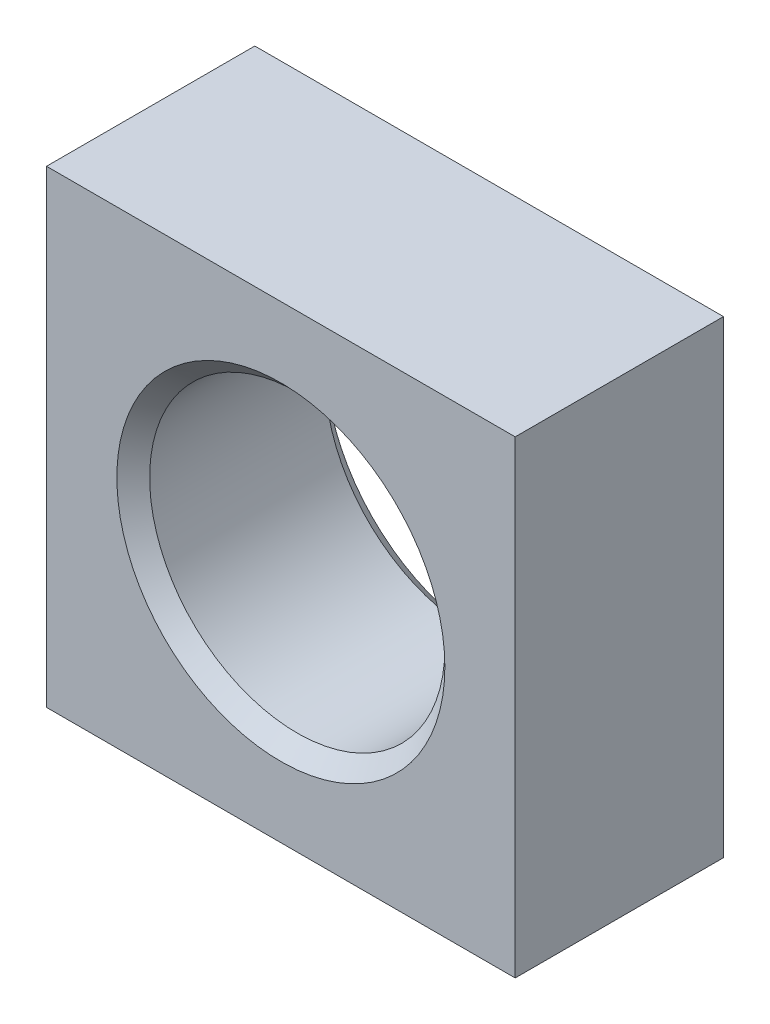
ISO-10303-21;
HEADER;
FILE_DESCRIPTION(('STEP AP214'),'2;1');
FILE_NAME('part.step','',(''),(''),'','','');
FILE_SCHEMA(('AUTOMOTIVE_DESIGN { 1 0 10303 214 1 1 1 1 }'));
ENDSEC;
DATA;
#1=APPLICATION_CONTEXT('core data for automotive mechanical design processes');
#2=APPLICATION_PROTOCOL_DEFINITION('international standard','automotive_design',2000,#1);
#3=PRODUCT_CONTEXT('',#1,'mechanical');
#4=PRODUCT('Part','Part','',(#3));
#5=PRODUCT_RELATED_PRODUCT_CATEGORY('part','',(#4));
#6=PRODUCT_DEFINITION_FORMATION('','',#4);
#7=PRODUCT_DEFINITION_CONTEXT('part definition',#1,'design');
#8=PRODUCT_DEFINITION('design','',#6,#7);
#9=PRODUCT_DEFINITION_SHAPE('','',#8);
#10=(LENGTH_UNIT() NAMED_UNIT(*) SI_UNIT(.MILLI.,.METRE.));
#11=(NAMED_UNIT(*) PLANE_ANGLE_UNIT() SI_UNIT($,.RADIAN.));
#12=(NAMED_UNIT(*) SI_UNIT($,.STERADIAN.) SOLID_ANGLE_UNIT());
#13=UNCERTAINTY_MEASURE_WITH_UNIT(LENGTH_MEASURE(1.E-05),#10,'distance_accuracy_value','');
#14=(GEOMETRIC_REPRESENTATION_CONTEXT(3) GLOBAL_UNCERTAINTY_ASSIGNED_CONTEXT((#13)) GLOBAL_UNIT_ASSIGNED_CONTEXT((#10,
#11,#12)) REPRESENTATION_CONTEXT('',''));
#15=CARTESIAN_POINT('',(0.,0.,0.));
#16=DIRECTION('',(0.,0.,1.));
#17=DIRECTION('',(1.,0.,0.));
#18=AXIS2_PLACEMENT_3D('',#15,#16,#17);
#19=CARTESIAN_POINT('',(14.2875,14.2875,-12.7));
#20=DIRECTION('',(1.,0.,0.));
#21=DIRECTION('',(0.,0.,-1.));
#22=AXIS2_PLACEMENT_3D('',#19,#20,#21);
#23=PLANE('',#22);
#24=DIRECTION('',(0.,1.,0.));
#25=VECTOR('',#24,1.);
#26=CARTESIAN_POINT('',(14.2875,14.2875,0.));
#27=LINE('',#26,#25);
#28=CARTESIAN_POINT('',(14.2875,-14.2875,0.));
#29=VERTEX_POINT('',#28);
#30=CARTESIAN_POINT('',(14.2875,14.2875,0.));
#31=VERTEX_POINT('',#30);
#32=EDGE_CURVE('E120',#29,#31,#27,.T.);
#33=ORIENTED_EDGE('',*,*,#32,.F.);
#34=DIRECTION('',(0.,0.,1.));
#35=VECTOR('',#34,1.);
#36=CARTESIAN_POINT('',(14.2875,-14.2875,-12.7));
#37=LINE('',#36,#35);
#38=CARTESIAN_POINT('',(14.2875,-14.2875,-12.7));
#39=VERTEX_POINT('',#38);
#40=EDGE_CURVE('E13',#39,#29,#37,.T.);
#41=ORIENTED_EDGE('',*,*,#40,.F.);
#42=DIRECTION('',(0.,1.,0.));
#43=VECTOR('',#42,1.);
#44=CARTESIAN_POINT('',(14.2875,14.2875,-12.7));
#45=LINE('',#44,#43);
#46=CARTESIAN_POINT('',(14.2875,14.2875,-12.7));
#47=VERTEX_POINT('',#46);
#48=EDGE_CURVE('E113',#39,#47,#45,.T.);
#49=ORIENTED_EDGE('',*,*,#48,.T.);
#50=DIRECTION('',(0.,0.,1.));
#51=VECTOR('',#50,1.);
#52=CARTESIAN_POINT('',(14.2875,14.2875,-12.7));
#53=LINE('',#52,#51);
#54=EDGE_CURVE('E58',#47,#31,#53,.T.);
#55=ORIENTED_EDGE('',*,*,#54,.T.);
#56=EDGE_LOOP('',(#33,#41,#49,#55));
#57=FACE_BOUND('',#56,.T.);
#58=ADVANCED_FACE('F55',(#57),#23,.T.);
#59=CARTESIAN_POINT('',(14.2875,-14.2875,-12.7));
#60=DIRECTION('',(0.,-1.,0.));
#61=DIRECTION('',(1.,0.,0.));
#62=AXIS2_PLACEMENT_3D('',#59,#60,#61);
#63=PLANE('',#62);
#64=DIRECTION('',(1.,0.,0.));
#65=VECTOR('',#64,1.);
#66=CARTESIAN_POINT('',(14.2875,-14.2875,0.));
#67=LINE('',#66,#65);
#68=CARTESIAN_POINT('',(-14.2875,-14.2875,0.));
#69=VERTEX_POINT('',#68);
#70=EDGE_CURVE('E115',#69,#29,#67,.T.);
#71=ORIENTED_EDGE('',*,*,#70,.F.);
#72=DIRECTION('',(0.,0.,1.));
#73=VECTOR('',#72,1.);
#74=CARTESIAN_POINT('',(-14.2875,-14.2875,-12.7));
#75=LINE('',#74,#73);
#76=CARTESIAN_POINT('',(-14.2875,-14.2875,-12.7));
#77=VERTEX_POINT('',#76);
#78=EDGE_CURVE('E64',#77,#69,#75,.T.);
#79=ORIENTED_EDGE('',*,*,#78,.F.);
#80=DIRECTION('',(1.,0.,0.));
#81=VECTOR('',#80,1.);
#82=CARTESIAN_POINT('',(14.2875,-14.2875,-12.7));
#83=LINE('',#82,#81);
#84=EDGE_CURVE('E110',#77,#39,#83,.T.);
#85=ORIENTED_EDGE('',*,*,#84,.T.);
#86=ORIENTED_EDGE('',*,*,#40,.T.);
#87=EDGE_LOOP('',(#71,#79,#85,#86));
#88=FACE_BOUND('',#87,.T.);
#89=ADVANCED_FACE('F131',(#88),#63,.T.);
#90=CARTESIAN_POINT('',(-14.2875,14.2875,-12.7));
#91=DIRECTION('',(-1.,0.,0.));
#92=DIRECTION('',(0.,-1.,0.));
#93=AXIS2_PLACEMENT_3D('',#90,#91,#92);
#94=PLANE('',#93);
#95=DIRECTION('',(0.,-1.,0.));
#96=VECTOR('',#95,1.);
#97=CARTESIAN_POINT('',(-14.2875,14.2875,0.));
#98=LINE('',#97,#96);
#99=CARTESIAN_POINT('',(-14.2875,14.2875,0.));
#100=VERTEX_POINT('',#99);
#101=EDGE_CURVE('E105',#100,#69,#98,.T.);
#102=ORIENTED_EDGE('',*,*,#101,.F.);
#103=DIRECTION('',(0.,0.,1.));
#104=VECTOR('',#103,1.);
#105=CARTESIAN_POINT('',(-14.2875,14.2875,-12.7));
#106=LINE('',#105,#104);
#107=CARTESIAN_POINT('',(-14.2875,14.2875,-12.7));
#108=VERTEX_POINT('',#107);
#109=EDGE_CURVE('E100',#108,#100,#106,.T.);
#110=ORIENTED_EDGE('',*,*,#109,.F.);
#111=DIRECTION('',(0.,-1.,0.));
#112=VECTOR('',#111,1.);
#113=CARTESIAN_POINT('',(-14.2875,14.2875,-12.7));
#114=LINE('',#113,#112);
#115=EDGE_CURVE('E103',#108,#77,#114,.T.);
#116=ORIENTED_EDGE('',*,*,#115,.T.);
#117=ORIENTED_EDGE('',*,*,#78,.T.);
#118=EDGE_LOOP('',(#102,#110,#116,#117));
#119=FACE_BOUND('',#118,.T.);
#120=ADVANCED_FACE('F102',(#119),#94,.T.);
#121=CARTESIAN_POINT('',(14.2875,14.2875,-12.7));
#122=DIRECTION('',(0.,1.,0.));
#123=DIRECTION('',(-1.,0.,0.));
#124=AXIS2_PLACEMENT_3D('',#121,#122,#123);
#125=PLANE('',#124);
#126=DIRECTION('',(-1.,0.,0.));
#127=VECTOR('',#126,1.);
#128=CARTESIAN_POINT('',(14.2875,14.2875,0.));
#129=LINE('',#128,#127);
#130=EDGE_CURVE('E123',#31,#100,#129,.T.);
#131=ORIENTED_EDGE('',*,*,#130,.F.);
#132=ORIENTED_EDGE('',*,*,#54,.F.);
#133=DIRECTION('',(-1.,0.,0.));
#134=VECTOR('',#133,1.);
#135=CARTESIAN_POINT('',(14.2875,14.2875,-12.7));
#136=LINE('',#135,#134);
#137=EDGE_CURVE('E109',#47,#108,#136,.T.);
#138=ORIENTED_EDGE('',*,*,#137,.T.);
#139=ORIENTED_EDGE('',*,*,#109,.T.);
#140=EDGE_LOOP('',(#131,#132,#138,#139));
#141=FACE_BOUND('',#140,.T.);
#142=ADVANCED_FACE('F112',(#141),#125,.T.);
#143=CARTESIAN_POINT('',(0.,0.,-12.7));
#144=DIRECTION('',(0.,0.,-1.));
#145=DIRECTION('',(-1.,0.,0.));
#146=AXIS2_PLACEMENT_3D('',#143,#144,#145);
#147=PLANE('',#146);
#148=CARTESIAN_POINT('',(0.,0.,-12.7));
#149=DIRECTION('',(0.,0.,1.));
#150=DIRECTION('',(1.,0.,0.));
#151=AXIS2_PLACEMENT_3D('',#148,#149,#150);
#152=CIRCLE('',#151,10.);
#153=CARTESIAN_POINT('',(10.,0.,-12.7));
#154=VERTEX_POINT('',#153);
#155=EDGE_CURVE('E172',#154,#154,#152,.T.);
#156=ORIENTED_EDGE('',*,*,#155,.T.);
#157=EDGE_LOOP('',(#156));
#158=FACE_BOUND('',#157,.T.);
#159=ORIENTED_EDGE('',*,*,#48,.F.);
#160=ORIENTED_EDGE('',*,*,#84,.F.);
#161=ORIENTED_EDGE('',*,*,#115,.F.);
#162=ORIENTED_EDGE('',*,*,#137,.F.);
#163=EDGE_LOOP('',(#159,#160,#161,#162));
#164=FACE_BOUND('',#163,.T.);
#165=ADVANCED_FACE('F108',(#158,#164),#147,.T.);
#166=CARTESIAN_POINT('',(0.,0.,0.));
#167=DIRECTION('',(0.,0.,-1.));
#168=DIRECTION('',(-1.,0.,0.));
#169=AXIS2_PLACEMENT_3D('',#166,#167,#168);
#170=PLANE('',#169);
#171=CARTESIAN_POINT('',(0.,0.,0.));
#172=DIRECTION('',(0.,0.,1.));
#173=DIRECTION('',(1.,0.,0.));
#174=AXIS2_PLACEMENT_3D('',#171,#172,#173);
#175=CIRCLE('',#174,10.);
#176=CARTESIAN_POINT('',(10.,0.,0.));
#177=VERTEX_POINT('',#176);
#178=EDGE_CURVE('E171',#177,#177,#175,.T.);
#179=ORIENTED_EDGE('',*,*,#178,.F.);
#180=EDGE_LOOP('',(#179));
#181=FACE_BOUND('',#180,.T.);
#182=ORIENTED_EDGE('',*,*,#32,.T.);
#183=ORIENTED_EDGE('',*,*,#130,.T.);
#184=ORIENTED_EDGE('',*,*,#101,.T.);
#185=ORIENTED_EDGE('',*,*,#70,.T.);
#186=EDGE_LOOP('',(#182,#183,#184,#185));
#187=FACE_BOUND('',#186,.T.);
#188=ADVANCED_FACE('F130',(#181,#187),#170,.F.);
#189=CARTESIAN_POINT('',(0.,0.,-11.7));
#190=DIRECTION('',(0.,0.,-1.));
#191=DIRECTION('',(-1.,0.,0.));
#192=AXIS2_PLACEMENT_3D('',#189,#190,#191);
#193=CONICAL_SURFACE('',#192,9.,0.785398163397448);
#194=ORIENTED_EDGE('',*,*,#155,.F.);
#195=EDGE_LOOP('',(#194));
#196=FACE_BOUND('',#195,.T.);
#197=CARTESIAN_POINT('',(0.,0.,-11.7));
#198=DIRECTION('',(0.,0.,1.));
#199=DIRECTION('',(1.,0.,0.));
#200=AXIS2_PLACEMENT_3D('',#197,#198,#199);
#201=CIRCLE('',#200,9.);
#202=CARTESIAN_POINT('',(9.,0.,-11.7));
#203=VERTEX_POINT('',#202);
#204=EDGE_CURVE('E124',#203,#203,#201,.T.);
#205=ORIENTED_EDGE('',*,*,#204,.T.);
#206=EDGE_LOOP('',(#205));
#207=FACE_BOUND('',#206,.T.);
#208=ADVANCED_FACE('F149',(#196,#207),#193,.F.);
#209=CARTESIAN_POINT('',(0.,0.,0.));
#210=DIRECTION('',(0.,0.,1.));
#211=DIRECTION('',(1.,0.,0.));
#212=AXIS2_PLACEMENT_3D('',#209,#210,#211);
#213=CYLINDRICAL_SURFACE('',#212,9.);
#214=ORIENTED_EDGE('',*,*,#204,.F.);
#215=EDGE_LOOP('',(#214));
#216=FACE_BOUND('',#215,.T.);
#217=CARTESIAN_POINT('',(0.,0.,-1.00000000000001));
#218=DIRECTION('',(0.,0.,1.));
#219=DIRECTION('',(1.,0.,0.));
#220=AXIS2_PLACEMENT_3D('',#217,#218,#219);
#221=CIRCLE('',#220,9.);
#222=CARTESIAN_POINT('',(9.,0.,-1.00000000000001));
#223=VERTEX_POINT('',#222);
#224=EDGE_CURVE('E168',#223,#223,#221,.T.);
#225=ORIENTED_EDGE('',*,*,#224,.T.);
#226=EDGE_LOOP('',(#225));
#227=FACE_BOUND('',#226,.T.);
#228=ADVANCED_FACE('F155',(#216,#227),#213,.F.);
#229=CARTESIAN_POINT('',(0.,0.,0.));
#230=DIRECTION('',(0.,0.,1.));
#231=DIRECTION('',(1.,0.,0.));
#232=AXIS2_PLACEMENT_3D('',#229,#230,#231);
#233=CONICAL_SURFACE('',#232,10.,0.785398163397446);
#234=ORIENTED_EDGE('',*,*,#224,.F.);
#235=EDGE_LOOP('',(#234));
#236=FACE_BOUND('',#235,.T.);
#237=ORIENTED_EDGE('',*,*,#178,.T.);
#238=EDGE_LOOP('',(#237));
#239=FACE_BOUND('',#238,.T.);
#240=ADVANCED_FACE('F159',(#236,#239),#233,.F.);
#241=CLOSED_SHELL('',(#58,#89,#120,#142,#165,#188,#208,#228,#240));
#242=MANIFOLD_SOLID_BREP('B2',#241);
#243=ADVANCED_BREP_SHAPE_REPRESENTATION('',(#18,#242),#14);
#244=SHAPE_DEFINITION_REPRESENTATION(#9,#243);
ENDSEC;
END-ISO-10303-21;
